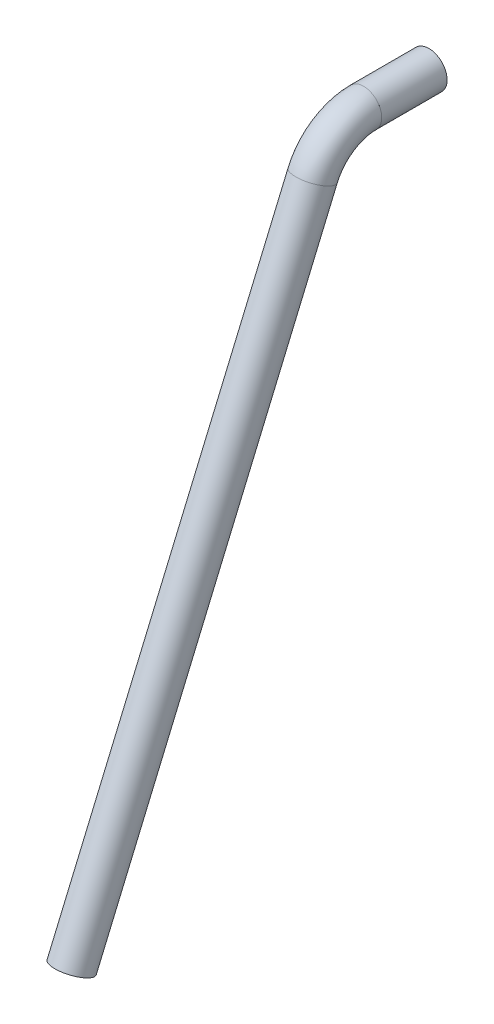
ISO-10303-21;
HEADER;
FILE_DESCRIPTION(('STEP AP214'),'2;1');
FILE_NAME('part.step','',(''),(''),'','','');
FILE_SCHEMA(('AUTOMOTIVE_DESIGN { 1 0 10303 214 1 1 1 1 }'));
ENDSEC;
DATA;
#1=APPLICATION_CONTEXT('core data for automotive mechanical design processes');
#2=APPLICATION_PROTOCOL_DEFINITION('international standard','automotive_design',2000,#1);
#3=PRODUCT_CONTEXT('',#1,'mechanical');
#4=PRODUCT('Part','Part','',(#3));
#5=PRODUCT_RELATED_PRODUCT_CATEGORY('part','',(#4));
#6=PRODUCT_DEFINITION_FORMATION('','',#4);
#7=PRODUCT_DEFINITION_CONTEXT('part definition',#1,'design');
#8=PRODUCT_DEFINITION('design','',#6,#7);
#9=PRODUCT_DEFINITION_SHAPE('','',#8);
#10=(LENGTH_UNIT() NAMED_UNIT(*) SI_UNIT(.MILLI.,.METRE.));
#11=(NAMED_UNIT(*) PLANE_ANGLE_UNIT() SI_UNIT($,.RADIAN.));
#12=(NAMED_UNIT(*) SI_UNIT($,.STERADIAN.) SOLID_ANGLE_UNIT());
#13=UNCERTAINTY_MEASURE_WITH_UNIT(LENGTH_MEASURE(1.E-05),#10,'distance_accuracy_value','');
#14=(GEOMETRIC_REPRESENTATION_CONTEXT(3) GLOBAL_UNCERTAINTY_ASSIGNED_CONTEXT((#13)) GLOBAL_UNIT_ASSIGNED_CONTEXT((#10,
#11,#12)) REPRESENTATION_CONTEXT('',''));
#15=CARTESIAN_POINT('',(0.,0.,0.));
#16=DIRECTION('',(0.,0.,1.));
#17=DIRECTION('',(1.,0.,0.));
#18=AXIS2_PLACEMENT_3D('',#15,#16,#17);
#19=CARTESIAN_POINT('',(0.,261.825193210267,-80.7348279116984));
#20=DIRECTION('',(0.,0.,-1.));
#21=DIRECTION('',(-1.,0.,0.));
#22=AXIS2_PLACEMENT_3D('',#19,#20,#21);
#23=CYLINDRICAL_SURFACE('',#22,13.3223);
#24=CARTESIAN_POINT('',(0.,261.825193210267,-140.734827911698));
#25=DIRECTION('',(0.,0.,1.));
#26=DIRECTION('',(0.,-1.,0.));
#27=AXIS2_PLACEMENT_3D('',#24,#25,#26);
#28=CIRCLE('',#27,13.3223);
#29=CARTESIAN_POINT('',(0.,248.502893210267,-140.734827911698));
#30=VERTEX_POINT('',#29);
#31=EDGE_CURVE('E57',#30,#30,#28,.T.);
#32=ORIENTED_EDGE('',*,*,#31,.F.);
#33=EDGE_LOOP('',(#32));
#34=FACE_BOUND('',#33,.T.);
#35=CARTESIAN_POINT('',(0.,261.825193210267,-80.7348279116984));
#36=DIRECTION('',(0.,0.,1.));
#37=DIRECTION('',(0.,-1.,0.));
#38=AXIS2_PLACEMENT_3D('',#35,#36,#37);
#39=CIRCLE('',#38,13.3223);
#40=CARTESIAN_POINT('',(0.,248.502893210267,-80.7348279116984));
#41=VERTEX_POINT('',#40);
#42=EDGE_CURVE('E53',#41,#41,#39,.T.);
#43=ORIENTED_EDGE('',*,*,#42,.T.);
#44=EDGE_LOOP('',(#43));
#45=FACE_BOUND('',#44,.T.);
#46=ADVANCED_FACE('F49',(#34,#45),#23,.F.);
#47=CARTESIAN_POINT('',(0.,261.825193210267,-80.7348279116984));
#48=DIRECTION('',(0.,0.,-1.));
#49=DIRECTION('',(-1.,0.,0.));
#50=AXIS2_PLACEMENT_3D('',#47,#48,#49);
#51=CYLINDRICAL_SURFACE('',#50,16.7005);
#52=CARTESIAN_POINT('',(0.,261.825193210267,-140.734827911698));
#53=DIRECTION('',(0.,0.,1.));
#54=DIRECTION('',(0.,-1.,0.));
#55=AXIS2_PLACEMENT_3D('',#52,#53,#54);
#56=CIRCLE('',#55,16.7005);
#57=CARTESIAN_POINT('',(0.,245.124693210267,-140.734827911698));
#58=VERTEX_POINT('',#57);
#59=EDGE_CURVE('E61',#58,#58,#56,.T.);
#60=ORIENTED_EDGE('',*,*,#59,.T.);
#61=EDGE_LOOP('',(#60));
#62=FACE_BOUND('',#61,.T.);
#63=CARTESIAN_POINT('',(0.,261.825193210267,-80.7348279116984));
#64=DIRECTION('',(0.,0.,1.));
#65=DIRECTION('',(0.,-1.,0.));
#66=AXIS2_PLACEMENT_3D('',#63,#64,#65);
#67=CIRCLE('',#66,16.7005);
#68=CARTESIAN_POINT('',(0.,245.124693210267,-80.7348279116984));
#69=VERTEX_POINT('',#68);
#70=EDGE_CURVE('E12',#69,#69,#67,.T.);
#71=ORIENTED_EDGE('',*,*,#70,.F.);
#72=EDGE_LOOP('',(#71));
#73=FACE_BOUND('',#72,.T.);
#74=ADVANCED_FACE('F76',(#62,#73),#51,.T.);
#75=CARTESIAN_POINT('',(0.,261.825193210267,-140.734827911698));
#76=DIRECTION('',(0.,0.,1.));
#77=DIRECTION('',(0.,-1.,0.));
#78=AXIS2_PLACEMENT_3D('',#75,#76,#77);
#79=PLANE('',#78);
#80=ORIENTED_EDGE('',*,*,#31,.T.);
#81=EDGE_LOOP('',(#80));
#82=FACE_BOUND('',#81,.T.);
#83=ORIENTED_EDGE('',*,*,#59,.F.);
#84=EDGE_LOOP('',(#83));
#85=FACE_BOUND('',#84,.T.);
#86=ADVANCED_FACE('F72',(#82,#85),#79,.F.);
#87=CARTESIAN_POINT('',(0.,261.825193210267,-80.7348279116984));
#88=DIRECTION('',(0.,0.,1.));
#89=DIRECTION('',(0.,-1.,0.));
#90=AXIS2_PLACEMENT_3D('',#87,#88,#89);
#91=PLANE('',#90);
#92=ORIENTED_EDGE('',*,*,#42,.F.);
#93=EDGE_LOOP('',(#92));
#94=FACE_BOUND('',#93,.T.);
#95=ORIENTED_EDGE('',*,*,#70,.T.);
#96=EDGE_LOOP('',(#95));
#97=FACE_BOUND('',#96,.T.);
#98=ADVANCED_FACE('F51',(#94,#97),#91,.T.);
#99=CLOSED_SHELL('',(#46,#74,#86,#98));
#100=MANIFOLD_SOLID_BREP('B2',#99);
#101=CARTESIAN_POINT('',(0.,211.025193210267,-80.7348279116984));
#102=DIRECTION('',(-1.,0.,0.));
#103=DIRECTION('',(0.,0.,1.));
#104=AXIS2_PLACEMENT_3D('',#101,#102,#103);
#105=TOROIDAL_SURFACE('',#104,50.8000000000001,13.3223);
#106=CARTESIAN_POINT('',(0.,230.946221036158,-34.0037606185145));
#107=DIRECTION('',(0.,-0.919902899472122,0.3921462170451));
#108=DIRECTION('',(0.,-0.3921462170451,-0.919902899472122));
#109=AXIS2_PLACEMENT_3D('',#106,#107,#108);
#110=CIRCLE('',#109,13.3223);
#111=CARTESIAN_POINT('',(0.,236.170510583498,-21.748538220877));
#112=VERTEX_POINT('',#111);
#113=EDGE_CURVE('E153',#112,#112,#110,.T.);
#114=CARTESIAN_POINT('',(0.,261.825193210267,-80.7348279116984));
#115=DIRECTION('',(0.,0.,-1.));
#116=DIRECTION('',(0.,1.,0.));
#117=AXIS2_PLACEMENT_3D('',#114,#115,#116);
#118=CIRCLE('',#117,13.3223);
#119=CARTESIAN_POINT('',(0.,275.147493210267,-80.7348279116983));
#120=VERTEX_POINT('',#119);
#121=EDGE_CURVE('E143',#120,#120,#118,.T.);
#122=CARTESIAN_POINT('',(0.,211.025193210267,-80.7348279116984));
#123=DIRECTION('',(-1.,0.,0.));
#124=DIRECTION('',(0.,0.,1.));
#125=AXIS2_PLACEMENT_3D('',#122,#123,#124);
#126=CIRCLE('',#125,64.1223000000002);
#127=EDGE_CURVE('',#112,#120,#126,.T.);
#128=ORIENTED_EDGE('',*,*,#113,.T.);
#129=ORIENTED_EDGE('',*,*,#121,.T.);
#130=ORIENTED_EDGE('',*,*,#127,.T.);
#131=ORIENTED_EDGE('',*,*,#127,.F.);
#132=EDGE_LOOP('',(#128,#130,#129,#131));
#133=FACE_BOUND('',#132,.T.);
#134=ADVANCED_FACE('F139',(#133),#105,.F.);
#135=CARTESIAN_POINT('',(0.,211.025193210267,-80.7348279116984));
#136=DIRECTION('',(-1.,0.,0.));
#137=DIRECTION('',(0.,0.,1.));
#138=AXIS2_PLACEMENT_3D('',#135,#136,#137);
#139=TOROIDAL_SURFACE('',#138,50.8000000000001,16.7005);
#140=CARTESIAN_POINT('',(0.,230.946221036158,-34.0037606185145));
#141=DIRECTION('',(0.,-0.919902899472122,0.3921462170451));
#142=DIRECTION('',(0.,-0.3921462170451,-0.919902899472122));
#143=AXIS2_PLACEMENT_3D('',#140,#141,#142);
#144=CIRCLE('',#143,16.7005);
#145=CARTESIAN_POINT('',(0.,237.49525893392,-18.6409222458803));
#146=VERTEX_POINT('',#145);
#147=EDGE_CURVE('E147',#146,#146,#144,.T.);
#148=CARTESIAN_POINT('',(0.,261.825193210267,-80.7348279116984));
#149=DIRECTION('',(0.,0.,-1.));
#150=DIRECTION('',(0.,1.,0.));
#151=AXIS2_PLACEMENT_3D('',#148,#149,#150);
#152=CIRCLE('',#151,16.7005);
#153=CARTESIAN_POINT('',(0.,278.525693210267,-80.7348279116983));
#154=VERTEX_POINT('',#153);
#155=EDGE_CURVE('E48',#154,#154,#152,.T.);
#156=CARTESIAN_POINT('',(0.,211.025193210267,-80.7348279116984));
#157=DIRECTION('',(-1.,0.,0.));
#158=DIRECTION('',(0.,0.,1.));
#159=AXIS2_PLACEMENT_3D('',#156,#157,#158);
#160=CIRCLE('',#159,67.5005000000001);
#161=EDGE_CURVE('',#146,#154,#160,.T.);
#162=ORIENTED_EDGE('',*,*,#147,.F.);
#163=ORIENTED_EDGE('',*,*,#155,.F.);
#164=ORIENTED_EDGE('',*,*,#161,.T.);
#165=ORIENTED_EDGE('',*,*,#161,.F.);
#166=EDGE_LOOP('',(#162,#164,#163,#165));
#167=FACE_BOUND('',#166,.T.);
#168=ADVANCED_FACE('F166',(#167),#139,.T.);
#169=CARTESIAN_POINT('',(0.,230.946221036158,-34.0037606185147));
#170=DIRECTION('',(0.,-0.919902899472122,0.3921462170451));
#171=DIRECTION('',(0.,-0.3921462170451,-0.919902899472122));
#172=AXIS2_PLACEMENT_3D('',#169,#170,#171);
#173=PLANE('',#172);
#174=ORIENTED_EDGE('',*,*,#113,.F.);
#175=EDGE_LOOP('',(#174));
#176=FACE_BOUND('',#175,.T.);
#177=ORIENTED_EDGE('',*,*,#147,.T.);
#178=EDGE_LOOP('',(#177));
#179=FACE_BOUND('',#178,.T.);
#180=ADVANCED_FACE('F162',(#176,#179),#173,.T.);
#181=CARTESIAN_POINT('',(0.,261.825193210267,-80.7348279116984));
#182=DIRECTION('',(0.,0.,-1.));
#183=DIRECTION('',(0.,1.,0.));
#184=AXIS2_PLACEMENT_3D('',#181,#182,#183);
#185=PLANE('',#184);
#186=ORIENTED_EDGE('',*,*,#121,.F.);
#187=EDGE_LOOP('',(#186));
#188=FACE_BOUND('',#187,.T.);
#189=ORIENTED_EDGE('',*,*,#155,.T.);
#190=EDGE_LOOP('',(#189));
#191=FACE_BOUND('',#190,.T.);
#192=ADVANCED_FACE('F141',(#188,#191),#185,.T.);
#193=CLOSED_SHELL('',(#134,#168,#180,#192));
#194=MANIFOLD_SOLID_BREP('B7',#193);
#195=CARTESIAN_POINT('',(0.,-287.810748137036,187.137604566643));
#196=DIRECTION('',(0.,0.919902899472122,-0.3921462170451));
#197=DIRECTION('',(0.,0.3921462170451,0.919902899472122));
#198=AXIS2_PLACEMENT_3D('',#195,#196,#197);
#199=CYLINDRICAL_SURFACE('',#198,13.3223);
#200=CARTESIAN_POINT('',(0.,-287.810748137036,187.137604566643));
#201=DIRECTION('',(0.,-0.919902899472122,0.3921462170451));
#202=DIRECTION('',(0.,-0.3921462170451,-0.919902899472122));
#203=AXIS2_PLACEMENT_3D('',#200,#201,#202);
#204=CIRCLE('',#203,13.3223);
#205=CARTESIAN_POINT('',(0.,-293.035037684376,174.882382169005));
#206=VERTEX_POINT('',#205);
#207=EDGE_CURVE('E238',#206,#206,#204,.T.);
#208=ORIENTED_EDGE('',*,*,#207,.T.);
#209=EDGE_LOOP('',(#208));
#210=FACE_BOUND('',#209,.T.);
#211=CARTESIAN_POINT('',(0.,230.946221036158,-34.0037606185148));
#212=DIRECTION('',(0.,0.919902899472122,-0.3921462170451));
#213=DIRECTION('',(0.,0.3921462170451,0.919902899472122));
#214=AXIS2_PLACEMENT_3D('',#211,#212,#213);
#215=CIRCLE('',#214,13.3223);
#216=CARTESIAN_POINT('',(0.,236.170510583498,-21.7485382208773));
#217=VERTEX_POINT('',#216);
#218=EDGE_CURVE('E228',#217,#217,#215,.T.);
#219=ORIENTED_EDGE('',*,*,#218,.T.);
#220=EDGE_LOOP('',(#219));
#221=FACE_BOUND('',#220,.T.);
#222=ADVANCED_FACE('F224',(#210,#221),#199,.F.);
#223=CARTESIAN_POINT('',(0.,-287.810748137036,187.137604566643));
#224=DIRECTION('',(0.,0.919902899472122,-0.3921462170451));
#225=DIRECTION('',(0.,0.3921462170451,0.919902899472122));
#226=AXIS2_PLACEMENT_3D('',#223,#224,#225);
#227=CYLINDRICAL_SURFACE('',#226,16.7005);
#228=CARTESIAN_POINT('',(0.,-287.810748137036,187.137604566643));
#229=DIRECTION('',(0.,-0.919902899472122,0.3921462170451));
#230=DIRECTION('',(0.,-0.3921462170451,-0.919902899472122));
#231=AXIS2_PLACEMENT_3D('',#228,#229,#230);
#232=CIRCLE('',#231,16.7005);
#233=CARTESIAN_POINT('',(0.,-294.359786034798,171.774766194008));
#234=VERTEX_POINT('',#233);
#235=EDGE_CURVE('E232',#234,#234,#232,.T.);
#236=ORIENTED_EDGE('',*,*,#235,.F.);
#237=EDGE_LOOP('',(#236));
#238=FACE_BOUND('',#237,.T.);
#239=CARTESIAN_POINT('',(0.,230.946221036158,-34.0037606185148));
#240=DIRECTION('',(0.,0.919902899472122,-0.3921462170451));
#241=DIRECTION('',(0.,0.3921462170451,0.919902899472122));
#242=AXIS2_PLACEMENT_3D('',#239,#240,#241);
#243=CIRCLE('',#242,16.7005);
#244=CARTESIAN_POINT('',(0.,237.49525893392,-18.6409222458806));
#245=VERTEX_POINT('',#244);
#246=EDGE_CURVE('E138',#245,#245,#243,.T.);
#247=ORIENTED_EDGE('',*,*,#246,.F.);
#248=EDGE_LOOP('',(#247));
#249=FACE_BOUND('',#248,.T.);
#250=ADVANCED_FACE('F251',(#238,#249),#227,.T.);
#251=CARTESIAN_POINT('',(0.,-287.810748137036,187.137604566643));
#252=DIRECTION('',(0.,-0.919902899472122,0.3921462170451));
#253=DIRECTION('',(0.,-0.3921462170451,-0.919902899472122));
#254=AXIS2_PLACEMENT_3D('',#251,#252,#253);
#255=PLANE('',#254);
#256=ORIENTED_EDGE('',*,*,#207,.F.);
#257=EDGE_LOOP('',(#256));
#258=FACE_BOUND('',#257,.T.);
#259=ORIENTED_EDGE('',*,*,#235,.T.);
#260=EDGE_LOOP('',(#259));
#261=FACE_BOUND('',#260,.T.);
#262=ADVANCED_FACE('F247',(#258,#261),#255,.T.);
#263=CARTESIAN_POINT('',(0.,230.946221036158,-34.0037606185147));
#264=DIRECTION('',(0.,0.919902899472122,-0.3921462170451));
#265=DIRECTION('',(0.,0.3921462170451,0.919902899472122));
#266=AXIS2_PLACEMENT_3D('',#263,#264,#265);
#267=PLANE('',#266);
#268=ORIENTED_EDGE('',*,*,#218,.F.);
#269=EDGE_LOOP('',(#268));
#270=FACE_BOUND('',#269,.T.);
#271=ORIENTED_EDGE('',*,*,#246,.T.);
#272=EDGE_LOOP('',(#271));
#273=FACE_BOUND('',#272,.T.);
#274=ADVANCED_FACE('F226',(#270,#273),#267,.T.);
#275=CLOSED_SHELL('',(#222,#250,#262,#274));
#276=MANIFOLD_SOLID_BREP('B43',#275);
#277=ADVANCED_BREP_SHAPE_REPRESENTATION('',(#18,#100,#194,#276),#14);
#278=SHAPE_DEFINITION_REPRESENTATION(#9,#277);
ENDSEC;
END-ISO-10303-21;
